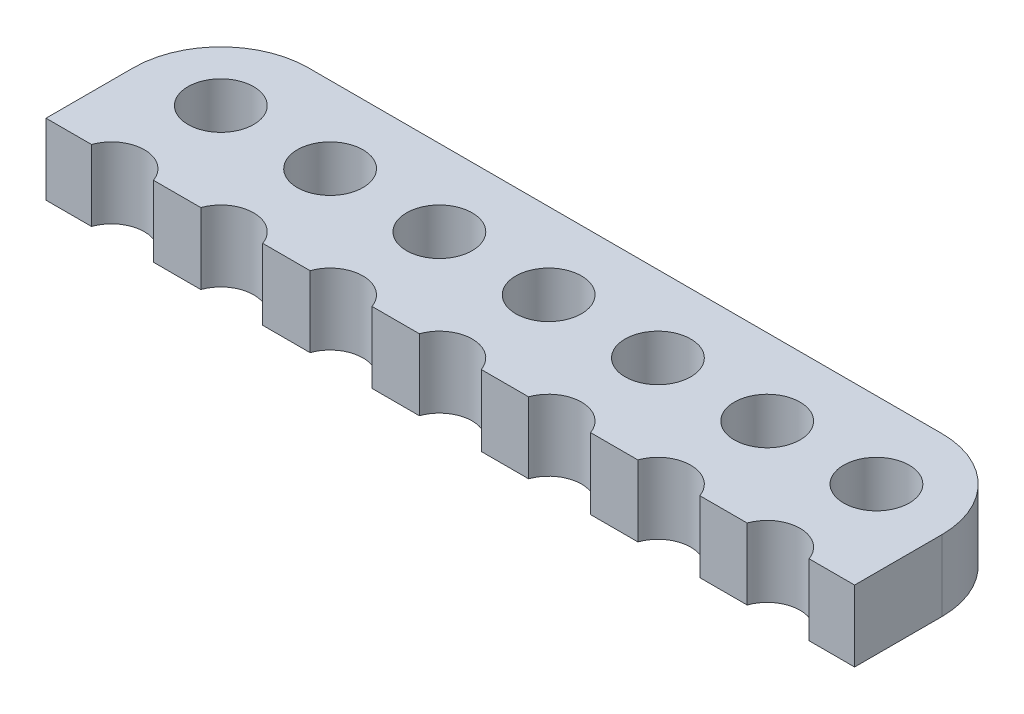
ISO-10303-21;
HEADER;
FILE_DESCRIPTION(('STEP AP214'),'2;1');
FILE_NAME('part.step','',(''),(''),'','','');
FILE_SCHEMA(('AUTOMOTIVE_DESIGN { 1 0 10303 214 1 1 1 1 }'));
ENDSEC;
DATA;
#1=APPLICATION_CONTEXT('core data for automotive mechanical design processes');
#2=APPLICATION_PROTOCOL_DEFINITION('international standard','automotive_design',2000,#1);
#3=PRODUCT_CONTEXT('',#1,'mechanical');
#4=PRODUCT('Part','Part','',(#3));
#5=PRODUCT_RELATED_PRODUCT_CATEGORY('part','',(#4));
#6=PRODUCT_DEFINITION_FORMATION('','',#4);
#7=PRODUCT_DEFINITION_CONTEXT('part definition',#1,'design');
#8=PRODUCT_DEFINITION('design','',#6,#7);
#9=PRODUCT_DEFINITION_SHAPE('','',#8);
#10=(LENGTH_UNIT() NAMED_UNIT(*) SI_UNIT(.MILLI.,.METRE.));
#11=(NAMED_UNIT(*) PLANE_ANGLE_UNIT() SI_UNIT($,.RADIAN.));
#12=(NAMED_UNIT(*) SI_UNIT($,.STERADIAN.) SOLID_ANGLE_UNIT());
#13=UNCERTAINTY_MEASURE_WITH_UNIT(LENGTH_MEASURE(1.E-05),#10,'distance_accuracy_value','');
#14=(GEOMETRIC_REPRESENTATION_CONTEXT(3) GLOBAL_UNCERTAINTY_ASSIGNED_CONTEXT((#13)) GLOBAL_UNIT_ASSIGNED_CONTEXT((#10,
#11,#12)) REPRESENTATION_CONTEXT('',''));
#15=CARTESIAN_POINT('',(0.,0.,0.));
#16=DIRECTION('',(0.,0.,1.));
#17=DIRECTION('',(1.,0.,0.));
#18=AXIS2_PLACEMENT_3D('',#15,#16,#17);
#19=CARTESIAN_POINT('',(14.5,3.25,0.));
#20=DIRECTION('',(0.,-1.,0.));
#21=DIRECTION('',(0.,0.,-1.));
#22=AXIS2_PLACEMENT_3D('',#19,#20,#21);
#23=PLANE('',#22);
#24=DIRECTION('',(1.,0.,0.));
#25=VECTOR('',#24,1.);
#26=CARTESIAN_POINT('',(16.4168649371059,3.25,4.));
#27=LINE('',#26,#25);
#28=CARTESIAN_POINT('',(16.4168649371059,3.25,4.));
#29=VERTEX_POINT('',#28);
#30=CARTESIAN_POINT('',(18.5,3.25,4.));
#31=VERTEX_POINT('',#30);
#32=EDGE_CURVE('E242',#29,#31,#27,.T.);
#33=ORIENTED_EDGE('',*,*,#32,.T.);
#34=DIRECTION('',(0.,0.,-1.));
#35=VECTOR('',#34,1.);
#36=CARTESIAN_POINT('',(18.5,3.25,0.));
#37=LINE('',#36,#35);
#38=CARTESIAN_POINT('',(18.5,3.25,0.));
#39=VERTEX_POINT('',#38);
#40=EDGE_CURVE('E130',#31,#39,#37,.T.);
#41=ORIENTED_EDGE('',*,*,#40,.T.);
#42=CARTESIAN_POINT('',(14.5,3.25,0.));
#43=DIRECTION('',(0.,1.,0.));
#44=DIRECTION('',(0.,0.,-1.));
#45=AXIS2_PLACEMENT_3D('',#42,#43,#44);
#46=CIRCLE('',#45,4.);
#47=CARTESIAN_POINT('',(14.5,3.25,-4.));
#48=VERTEX_POINT('',#47);
#49=EDGE_CURVE('E293',#39,#48,#46,.T.);
#50=ORIENTED_EDGE('',*,*,#49,.T.);
#51=DIRECTION('',(-1.,0.,0.));
#52=VECTOR('',#51,1.);
#53=CARTESIAN_POINT('',(-14.5,3.25,-4.));
#54=LINE('',#53,#52);
#55=CARTESIAN_POINT('',(-14.5,3.25,-4.));
#56=VERTEX_POINT('',#55);
#57=EDGE_CURVE('E312',#48,#56,#54,.T.);
#58=ORIENTED_EDGE('',*,*,#57,.T.);
#59=CARTESIAN_POINT('',(-14.5,3.25,0.));
#60=DIRECTION('',(0.,1.,0.));
#61=DIRECTION('',(0.,0.,1.));
#62=AXIS2_PLACEMENT_3D('',#59,#60,#61);
#63=CIRCLE('',#62,4.);
#64=CARTESIAN_POINT('',(-18.5,3.25,0.));
#65=VERTEX_POINT('',#64);
#66=EDGE_CURVE('E309',#56,#65,#63,.T.);
#67=ORIENTED_EDGE('',*,*,#66,.T.);
#68=DIRECTION('',(0.,0.,1.));
#69=VECTOR('',#68,1.);
#70=CARTESIAN_POINT('',(-18.5,3.25,0.));
#71=LINE('',#70,#69);
#72=CARTESIAN_POINT('',(-18.5,3.25,4.));
#73=VERTEX_POINT('',#72);
#74=EDGE_CURVE('E311',#65,#73,#71,.T.);
#75=ORIENTED_EDGE('',*,*,#74,.T.);
#76=DIRECTION('',(1.,0.,0.));
#77=VECTOR('',#76,1.);
#78=CARTESIAN_POINT('',(-18.5,3.25,4.));
#79=LINE('',#78,#77);
#80=CARTESIAN_POINT('',(-16.4168649371058,3.25,4.));
#81=VERTEX_POINT('',#80);
#82=EDGE_CURVE('E314',#73,#81,#79,.T.);
#83=ORIENTED_EDGE('',*,*,#82,.T.);
#84=CARTESIAN_POINT('',(-15.,3.25,4.5));
#85=DIRECTION('',(0.,-1.,0.));
#86=DIRECTION('',(0.,0.,1.));
#87=AXIS2_PLACEMENT_3D('',#84,#85,#86);
#88=CIRCLE('',#87,1.5025);
#89=CARTESIAN_POINT('',(-13.5831350628941,3.25,4.));
#90=VERTEX_POINT('',#89);
#91=EDGE_CURVE('E320',#81,#90,#88,.T.);
#92=ORIENTED_EDGE('',*,*,#91,.T.);
#93=DIRECTION('',(1.,0.,0.));
#94=VECTOR('',#93,1.);
#95=CARTESIAN_POINT('',(-13.5831350628941,3.25,4.));
#96=LINE('',#95,#94);
#97=CARTESIAN_POINT('',(-11.4168649371058,3.25,4.));
#98=VERTEX_POINT('',#97);
#99=EDGE_CURVE('E322',#90,#98,#96,.T.);
#100=ORIENTED_EDGE('',*,*,#99,.T.);
#101=CARTESIAN_POINT('',(-9.99999999999995,3.25,4.5));
#102=DIRECTION('',(0.,-1.,0.));
#103=DIRECTION('',(0.,0.,1.));
#104=AXIS2_PLACEMENT_3D('',#101,#102,#103);
#105=CIRCLE('',#104,1.5025);
#106=CARTESIAN_POINT('',(-8.58313506289409,3.25,4.));
#107=VERTEX_POINT('',#106);
#108=EDGE_CURVE('E324',#98,#107,#105,.T.);
#109=ORIENTED_EDGE('',*,*,#108,.T.);
#110=DIRECTION('',(1.,0.,0.));
#111=VECTOR('',#110,1.);
#112=CARTESIAN_POINT('',(-8.58313506289409,3.25,4.));
#113=LINE('',#112,#111);
#114=CARTESIAN_POINT('',(-6.41686493710581,3.25,4.));
#115=VERTEX_POINT('',#114);
#116=EDGE_CURVE('E326',#107,#115,#113,.T.);
#117=ORIENTED_EDGE('',*,*,#116,.T.);
#118=CARTESIAN_POINT('',(-4.99999999999995,3.25,4.5));
#119=DIRECTION('',(0.,-1.,0.));
#120=DIRECTION('',(0.,0.,1.));
#121=AXIS2_PLACEMENT_3D('',#118,#119,#120);
#122=CIRCLE('',#121,1.5025);
#123=CARTESIAN_POINT('',(-3.58313506289409,3.25,4.));
#124=VERTEX_POINT('',#123);
#125=EDGE_CURVE('E328',#115,#124,#122,.T.);
#126=ORIENTED_EDGE('',*,*,#125,.T.);
#127=DIRECTION('',(1.,0.,0.));
#128=VECTOR('',#127,1.);
#129=CARTESIAN_POINT('',(-3.58313506289409,3.25,4.));
#130=LINE('',#129,#128);
#131=CARTESIAN_POINT('',(-1.41686493710581,3.25,4.));
#132=VERTEX_POINT('',#131);
#133=EDGE_CURVE('E330',#124,#132,#130,.T.);
#134=ORIENTED_EDGE('',*,*,#133,.T.);
#135=CARTESIAN_POINT('',(0.,3.25,4.5));
#136=DIRECTION('',(0.,-1.,0.));
#137=DIRECTION('',(0.,0.,1.));
#138=AXIS2_PLACEMENT_3D('',#135,#136,#137);
#139=CIRCLE('',#138,1.5025);
#140=CARTESIAN_POINT('',(1.41686493710591,3.25,4.));
#141=VERTEX_POINT('',#140);
#142=EDGE_CURVE('E332',#132,#141,#139,.T.);
#143=ORIENTED_EDGE('',*,*,#142,.T.);
#144=DIRECTION('',(1.,0.,0.));
#145=VECTOR('',#144,1.);
#146=CARTESIAN_POINT('',(1.41686493710591,3.25,4.));
#147=LINE('',#146,#145);
#148=CARTESIAN_POINT('',(3.58313506289419,3.25,4.));
#149=VERTEX_POINT('',#148);
#150=EDGE_CURVE('E334',#141,#149,#147,.T.);
#151=ORIENTED_EDGE('',*,*,#150,.T.);
#152=CARTESIAN_POINT('',(5.00000000000005,3.25,4.5));
#153=DIRECTION('',(0.,-1.,0.));
#154=DIRECTION('',(0.,0.,1.));
#155=AXIS2_PLACEMENT_3D('',#152,#153,#154);
#156=CIRCLE('',#155,1.5025);
#157=CARTESIAN_POINT('',(6.41686493710591,3.25,4.));
#158=VERTEX_POINT('',#157);
#159=EDGE_CURVE('E336',#149,#158,#156,.T.);
#160=ORIENTED_EDGE('',*,*,#159,.T.);
#161=DIRECTION('',(1.,0.,0.));
#162=VECTOR('',#161,1.);
#163=CARTESIAN_POINT('',(6.41686493710591,3.25,4.));
#164=LINE('',#163,#162);
#165=CARTESIAN_POINT('',(8.58313506289419,3.25,4.));
#166=VERTEX_POINT('',#165);
#167=EDGE_CURVE('E185',#158,#166,#164,.T.);
#168=ORIENTED_EDGE('',*,*,#167,.T.);
#169=CARTESIAN_POINT('',(10.,3.25,4.5));
#170=DIRECTION('',(0.,-1.,0.));
#171=DIRECTION('',(0.,0.,1.));
#172=AXIS2_PLACEMENT_3D('',#169,#170,#171);
#173=CIRCLE('',#172,1.5025);
#174=CARTESIAN_POINT('',(11.4168649371059,3.25,4.));
#175=VERTEX_POINT('',#174);
#176=EDGE_CURVE('E179',#166,#175,#173,.T.);
#177=ORIENTED_EDGE('',*,*,#176,.T.);
#178=DIRECTION('',(1.,0.,0.));
#179=VECTOR('',#178,1.);
#180=CARTESIAN_POINT('',(11.4168649371059,3.25,4.));
#181=LINE('',#180,#179);
#182=CARTESIAN_POINT('',(13.5831350628942,3.25,4.));
#183=VERTEX_POINT('',#182);
#184=EDGE_CURVE('E183',#175,#183,#181,.T.);
#185=ORIENTED_EDGE('',*,*,#184,.T.);
#186=CARTESIAN_POINT('',(15.,3.25,4.5));
#187=DIRECTION('',(0.,-1.,0.));
#188=DIRECTION('',(0.,0.,1.));
#189=AXIS2_PLACEMENT_3D('',#186,#187,#188);
#190=CIRCLE('',#189,1.5025);
#191=EDGE_CURVE('E51',#183,#29,#190,.T.);
#192=ORIENTED_EDGE('',*,*,#191,.T.);
#193=EDGE_LOOP('',(#33,#41,#50,#58,#67,#75,#83,#92,#100,#109,#117,#126,#134,#143,#151,#160,#168,
#177,#185,#192));
#194=FACE_BOUND('',#193,.T.);
#195=CARTESIAN_POINT('',(-15.,3.25,-0.5));
#196=DIRECTION('',(0.,1.,0.));
#197=DIRECTION('',(0.,0.,1.));
#198=AXIS2_PLACEMENT_3D('',#195,#196,#197);
#199=CIRCLE('',#198,1.5025);
#200=CARTESIAN_POINT('',(-15.,3.25,1.0025));
#201=VERTEX_POINT('',#200);
#202=EDGE_CURVE('E207',#201,#201,#199,.T.);
#203=ORIENTED_EDGE('',*,*,#202,.F.);
#204=EDGE_LOOP('',(#203));
#205=FACE_BOUND('',#204,.T.);
#206=CARTESIAN_POINT('',(-10.,3.25,-0.5));
#207=DIRECTION('',(0.,1.,0.));
#208=DIRECTION('',(0.,0.,1.));
#209=AXIS2_PLACEMENT_3D('',#206,#207,#208);
#210=CIRCLE('',#209,1.5025);
#211=CARTESIAN_POINT('',(-10.,3.25,1.0025));
#212=VERTEX_POINT('',#211);
#213=EDGE_CURVE('E430',#212,#212,#210,.T.);
#214=ORIENTED_EDGE('',*,*,#213,.F.);
#215=EDGE_LOOP('',(#214));
#216=FACE_BOUND('',#215,.T.);
#217=CARTESIAN_POINT('',(-5.,3.25,-0.5));
#218=DIRECTION('',(0.,1.,0.));
#219=DIRECTION('',(0.,0.,1.));
#220=AXIS2_PLACEMENT_3D('',#217,#218,#219);
#221=CIRCLE('',#220,1.5025);
#222=CARTESIAN_POINT('',(-5.,3.25,1.0025));
#223=VERTEX_POINT('',#222);
#224=EDGE_CURVE('E424',#223,#223,#221,.T.);
#225=ORIENTED_EDGE('',*,*,#224,.F.);
#226=EDGE_LOOP('',(#225));
#227=FACE_BOUND('',#226,.T.);
#228=CARTESIAN_POINT('',(0.,3.25,-0.5));
#229=DIRECTION('',(0.,1.,0.));
#230=DIRECTION('',(0.,0.,1.));
#231=AXIS2_PLACEMENT_3D('',#228,#229,#230);
#232=CIRCLE('',#231,1.5025);
#233=CARTESIAN_POINT('',(0.,3.25,1.0025));
#234=VERTEX_POINT('',#233);
#235=EDGE_CURVE('E418',#234,#234,#232,.T.);
#236=ORIENTED_EDGE('',*,*,#235,.F.);
#237=EDGE_LOOP('',(#236));
#238=FACE_BOUND('',#237,.T.);
#239=CARTESIAN_POINT('',(5.,3.25,-0.5));
#240=DIRECTION('',(0.,1.,0.));
#241=DIRECTION('',(0.,0.,1.));
#242=AXIS2_PLACEMENT_3D('',#239,#240,#241);
#243=CIRCLE('',#242,1.5025);
#244=CARTESIAN_POINT('',(5.,3.25,1.0025));
#245=VERTEX_POINT('',#244);
#246=EDGE_CURVE('E412',#245,#245,#243,.T.);
#247=ORIENTED_EDGE('',*,*,#246,.F.);
#248=EDGE_LOOP('',(#247));
#249=FACE_BOUND('',#248,.T.);
#250=CARTESIAN_POINT('',(10.,3.25,-0.5));
#251=DIRECTION('',(0.,1.,0.));
#252=DIRECTION('',(0.,0.,1.));
#253=AXIS2_PLACEMENT_3D('',#250,#251,#252);
#254=CIRCLE('',#253,1.5025);
#255=CARTESIAN_POINT('',(10.,3.25,1.0025));
#256=VERTEX_POINT('',#255);
#257=EDGE_CURVE('E406',#256,#256,#254,.T.);
#258=ORIENTED_EDGE('',*,*,#257,.F.);
#259=EDGE_LOOP('',(#258));
#260=FACE_BOUND('',#259,.T.);
#261=CARTESIAN_POINT('',(15.,3.25,-0.5));
#262=DIRECTION('',(0.,1.,0.));
#263=DIRECTION('',(0.,0.,1.));
#264=AXIS2_PLACEMENT_3D('',#261,#262,#263);
#265=CIRCLE('',#264,1.5025);
#266=CARTESIAN_POINT('',(15.,3.25,1.0025));
#267=VERTEX_POINT('',#266);
#268=EDGE_CURVE('E397',#267,#267,#265,.T.);
#269=ORIENTED_EDGE('',*,*,#268,.F.);
#270=EDGE_LOOP('',(#269));
#271=FACE_BOUND('',#270,.T.);
#272=ADVANCED_FACE('F34',(#194,#205,#216,#227,#238,#249,#260,#271),#23,.F.);
#273=CARTESIAN_POINT('',(14.5,0.,0.));
#274=DIRECTION('',(0.,-1.,0.));
#275=DIRECTION('',(0.,0.,-1.));
#276=AXIS2_PLACEMENT_3D('',#273,#274,#275);
#277=PLANE('',#276);
#278=CARTESIAN_POINT('',(10.,0.,-0.5));
#279=DIRECTION('',(0.,1.,0.));
#280=DIRECTION('',(0.,0.,1.));
#281=AXIS2_PLACEMENT_3D('',#278,#279,#280);
#282=CIRCLE('',#281,1.5025);
#283=CARTESIAN_POINT('',(10.,0.,1.0025));
#284=VERTEX_POINT('',#283);
#285=EDGE_CURVE('E403',#284,#284,#282,.T.);
#286=ORIENTED_EDGE('',*,*,#285,.T.);
#287=EDGE_LOOP('',(#286));
#288=FACE_BOUND('',#287,.T.);
#289=CARTESIAN_POINT('',(0.,0.,-0.5));
#290=DIRECTION('',(0.,1.,0.));
#291=DIRECTION('',(0.,0.,1.));
#292=AXIS2_PLACEMENT_3D('',#289,#290,#291);
#293=CIRCLE('',#292,1.5025);
#294=CARTESIAN_POINT('',(0.,0.,1.0025));
#295=VERTEX_POINT('',#294);
#296=EDGE_CURVE('E415',#295,#295,#293,.T.);
#297=ORIENTED_EDGE('',*,*,#296,.T.);
#298=EDGE_LOOP('',(#297));
#299=FACE_BOUND('',#298,.T.);
#300=CARTESIAN_POINT('',(-10.,0.,-0.5));
#301=DIRECTION('',(0.,1.,0.));
#302=DIRECTION('',(0.,0.,1.));
#303=AXIS2_PLACEMENT_3D('',#300,#301,#302);
#304=CIRCLE('',#303,1.5025);
#305=CARTESIAN_POINT('',(-10.,0.,1.0025));
#306=VERTEX_POINT('',#305);
#307=EDGE_CURVE('E427',#306,#306,#304,.T.);
#308=ORIENTED_EDGE('',*,*,#307,.T.);
#309=EDGE_LOOP('',(#308));
#310=FACE_BOUND('',#309,.T.);
#311=DIRECTION('',(1.,0.,0.));
#312=VECTOR('',#311,1.);
#313=CARTESIAN_POINT('',(16.4168649371059,0.,4.));
#314=LINE('',#313,#312);
#315=CARTESIAN_POINT('',(16.4168649371059,0.,4.));
#316=VERTEX_POINT('',#315);
#317=CARTESIAN_POINT('',(18.5,0.,4.));
#318=VERTEX_POINT('',#317);
#319=EDGE_CURVE('E203',#316,#318,#314,.T.);
#320=ORIENTED_EDGE('',*,*,#319,.F.);
#321=CARTESIAN_POINT('',(15.,0.,4.5));
#322=DIRECTION('',(0.,-1.,0.));
#323=DIRECTION('',(0.,0.,1.));
#324=AXIS2_PLACEMENT_3D('',#321,#322,#323);
#325=CIRCLE('',#324,1.5025);
#326=CARTESIAN_POINT('',(13.5831350628942,0.,4.));
#327=VERTEX_POINT('',#326);
#328=EDGE_CURVE('E122',#327,#316,#325,.T.);
#329=ORIENTED_EDGE('',*,*,#328,.F.);
#330=DIRECTION('',(1.,0.,0.));
#331=VECTOR('',#330,1.);
#332=CARTESIAN_POINT('',(11.4168649371059,0.,4.));
#333=LINE('',#332,#331);
#334=CARTESIAN_POINT('',(11.4168649371059,0.,4.));
#335=VERTEX_POINT('',#334);
#336=EDGE_CURVE('E116',#335,#327,#333,.T.);
#337=ORIENTED_EDGE('',*,*,#336,.F.);
#338=CARTESIAN_POINT('',(10.,0.,4.5));
#339=DIRECTION('',(0.,-1.,0.));
#340=DIRECTION('',(0.,0.,1.));
#341=AXIS2_PLACEMENT_3D('',#338,#339,#340);
#342=CIRCLE('',#341,1.5025);
#343=CARTESIAN_POINT('',(8.58313506289419,0.,4.));
#344=VERTEX_POINT('',#343);
#345=EDGE_CURVE('E193',#344,#335,#342,.T.);
#346=ORIENTED_EDGE('',*,*,#345,.F.);
#347=DIRECTION('',(1.,0.,0.));
#348=VECTOR('',#347,1.);
#349=CARTESIAN_POINT('',(6.41686493710591,0.,4.));
#350=LINE('',#349,#348);
#351=CARTESIAN_POINT('',(6.41686493710591,0.,4.));
#352=VERTEX_POINT('',#351);
#353=EDGE_CURVE('E237',#352,#344,#350,.T.);
#354=ORIENTED_EDGE('',*,*,#353,.F.);
#355=CARTESIAN_POINT('',(5.00000000000005,0.,4.5));
#356=DIRECTION('',(0.,-1.,0.));
#357=DIRECTION('',(0.,0.,1.));
#358=AXIS2_PLACEMENT_3D('',#355,#356,#357);
#359=CIRCLE('',#358,1.5025);
#360=CARTESIAN_POINT('',(3.58313506289419,0.,4.));
#361=VERTEX_POINT('',#360);
#362=EDGE_CURVE('E235',#361,#352,#359,.T.);
#363=ORIENTED_EDGE('',*,*,#362,.F.);
#364=DIRECTION('',(1.,0.,0.));
#365=VECTOR('',#364,1.);
#366=CARTESIAN_POINT('',(1.41686493710591,0.,4.));
#367=LINE('',#366,#365);
#368=CARTESIAN_POINT('',(1.41686493710591,0.,4.));
#369=VERTEX_POINT('',#368);
#370=EDGE_CURVE('E233',#369,#361,#367,.T.);
#371=ORIENTED_EDGE('',*,*,#370,.F.);
#372=CARTESIAN_POINT('',(0.,0.,4.5));
#373=DIRECTION('',(0.,-1.,0.));
#374=DIRECTION('',(0.,0.,1.));
#375=AXIS2_PLACEMENT_3D('',#372,#373,#374);
#376=CIRCLE('',#375,1.5025);
#377=CARTESIAN_POINT('',(-1.41686493710581,0.,4.));
#378=VERTEX_POINT('',#377);
#379=EDGE_CURVE('E231',#378,#369,#376,.T.);
#380=ORIENTED_EDGE('',*,*,#379,.F.);
#381=DIRECTION('',(1.,0.,0.));
#382=VECTOR('',#381,1.);
#383=CARTESIAN_POINT('',(-3.58313506289409,0.,4.));
#384=LINE('',#383,#382);
#385=CARTESIAN_POINT('',(-3.58313506289409,0.,4.));
#386=VERTEX_POINT('',#385);
#387=EDGE_CURVE('E229',#386,#378,#384,.T.);
#388=ORIENTED_EDGE('',*,*,#387,.F.);
#389=CARTESIAN_POINT('',(-4.99999999999995,0.,4.5));
#390=DIRECTION('',(0.,-1.,0.));
#391=DIRECTION('',(0.,0.,1.));
#392=AXIS2_PLACEMENT_3D('',#389,#390,#391);
#393=CIRCLE('',#392,1.5025);
#394=CARTESIAN_POINT('',(-6.41686493710581,0.,4.));
#395=VERTEX_POINT('',#394);
#396=EDGE_CURVE('E227',#395,#386,#393,.T.);
#397=ORIENTED_EDGE('',*,*,#396,.F.);
#398=DIRECTION('',(1.,0.,0.));
#399=VECTOR('',#398,1.);
#400=CARTESIAN_POINT('',(-8.58313506289409,0.,4.));
#401=LINE('',#400,#399);
#402=CARTESIAN_POINT('',(-8.58313506289409,0.,4.));
#403=VERTEX_POINT('',#402);
#404=EDGE_CURVE('E225',#403,#395,#401,.T.);
#405=ORIENTED_EDGE('',*,*,#404,.F.);
#406=CARTESIAN_POINT('',(-9.99999999999995,0.,4.5));
#407=DIRECTION('',(0.,-1.,0.));
#408=DIRECTION('',(0.,0.,1.));
#409=AXIS2_PLACEMENT_3D('',#406,#407,#408);
#410=CIRCLE('',#409,1.5025);
#411=CARTESIAN_POINT('',(-11.4168649371058,0.,4.));
#412=VERTEX_POINT('',#411);
#413=EDGE_CURVE('E223',#412,#403,#410,.T.);
#414=ORIENTED_EDGE('',*,*,#413,.F.);
#415=DIRECTION('',(1.,0.,0.));
#416=VECTOR('',#415,1.);
#417=CARTESIAN_POINT('',(-13.5831350628941,0.,4.));
#418=LINE('',#417,#416);
#419=CARTESIAN_POINT('',(-13.5831350628941,0.,4.));
#420=VERTEX_POINT('',#419);
#421=EDGE_CURVE('E221',#420,#412,#418,.T.);
#422=ORIENTED_EDGE('',*,*,#421,.F.);
#423=CARTESIAN_POINT('',(-15.,0.,4.5));
#424=DIRECTION('',(0.,-1.,0.));
#425=DIRECTION('',(0.,0.,1.));
#426=AXIS2_PLACEMENT_3D('',#423,#424,#425);
#427=CIRCLE('',#426,1.5025);
#428=CARTESIAN_POINT('',(-16.4168649371058,0.,4.));
#429=VERTEX_POINT('',#428);
#430=EDGE_CURVE('E219',#429,#420,#427,.T.);
#431=ORIENTED_EDGE('',*,*,#430,.F.);
#432=DIRECTION('',(1.,0.,0.));
#433=VECTOR('',#432,1.);
#434=CARTESIAN_POINT('',(-18.5,0.,4.));
#435=LINE('',#434,#433);
#436=CARTESIAN_POINT('',(-18.5,0.,4.));
#437=VERTEX_POINT('',#436);
#438=EDGE_CURVE('E217',#437,#429,#435,.T.);
#439=ORIENTED_EDGE('',*,*,#438,.F.);
#440=DIRECTION('',(0.,0.,1.));
#441=VECTOR('',#440,1.);
#442=CARTESIAN_POINT('',(-18.5,0.,0.));
#443=LINE('',#442,#441);
#444=CARTESIAN_POINT('',(-18.5,0.,0.));
#445=VERTEX_POINT('',#444);
#446=EDGE_CURVE('E215',#445,#437,#443,.T.);
#447=ORIENTED_EDGE('',*,*,#446,.F.);
#448=CARTESIAN_POINT('',(-14.5,0.,0.));
#449=DIRECTION('',(0.,1.,0.));
#450=DIRECTION('',(0.,0.,1.));
#451=AXIS2_PLACEMENT_3D('',#448,#449,#450);
#452=CIRCLE('',#451,4.);
#453=CARTESIAN_POINT('',(-14.5,0.,-4.));
#454=VERTEX_POINT('',#453);
#455=EDGE_CURVE('E213',#454,#445,#452,.T.);
#456=ORIENTED_EDGE('',*,*,#455,.F.);
#457=DIRECTION('',(-1.,0.,0.));
#458=VECTOR('',#457,1.);
#459=CARTESIAN_POINT('',(-14.5,0.,-4.));
#460=LINE('',#459,#458);
#461=CARTESIAN_POINT('',(14.5,0.,-4.));
#462=VERTEX_POINT('',#461);
#463=EDGE_CURVE('E211',#462,#454,#460,.T.);
#464=ORIENTED_EDGE('',*,*,#463,.F.);
#465=CARTESIAN_POINT('',(14.5,0.,0.));
#466=DIRECTION('',(0.,1.,0.));
#467=DIRECTION('',(0.,0.,-1.));
#468=AXIS2_PLACEMENT_3D('',#465,#466,#467);
#469=CIRCLE('',#468,4.);
#470=CARTESIAN_POINT('',(18.5,0.,0.));
#471=VERTEX_POINT('',#470);
#472=EDGE_CURVE('E209',#471,#462,#469,.T.);
#473=ORIENTED_EDGE('',*,*,#472,.F.);
#474=DIRECTION('',(0.,0.,-1.));
#475=VECTOR('',#474,1.);
#476=CARTESIAN_POINT('',(18.5,0.,0.));
#477=LINE('',#476,#475);
#478=EDGE_CURVE('E206',#318,#471,#477,.T.);
#479=ORIENTED_EDGE('',*,*,#478,.F.);
#480=EDGE_LOOP('',(#320,#329,#337,#346,#354,#363,#371,#380,#388,#397,#405,#414,#422,#431,#439,
#447,#456,#464,#473,#479));
#481=FACE_BOUND('',#480,.T.);
#482=CARTESIAN_POINT('',(-15.,0.,-0.5));
#483=DIRECTION('',(0.,1.,0.));
#484=DIRECTION('',(0.,0.,1.));
#485=AXIS2_PLACEMENT_3D('',#482,#483,#484);
#486=CIRCLE('',#485,1.5025);
#487=CARTESIAN_POINT('',(-15.,0.,1.0025));
#488=VERTEX_POINT('',#487);
#489=EDGE_CURVE('E433',#488,#488,#486,.T.);
#490=ORIENTED_EDGE('',*,*,#489,.T.);
#491=EDGE_LOOP('',(#490));
#492=FACE_BOUND('',#491,.T.);
#493=CARTESIAN_POINT('',(-5.,0.,-0.5));
#494=DIRECTION('',(0.,1.,0.));
#495=DIRECTION('',(0.,0.,1.));
#496=AXIS2_PLACEMENT_3D('',#493,#494,#495);
#497=CIRCLE('',#496,1.5025);
#498=CARTESIAN_POINT('',(-5.,0.,1.0025));
#499=VERTEX_POINT('',#498);
#500=EDGE_CURVE('E421',#499,#499,#497,.T.);
#501=ORIENTED_EDGE('',*,*,#500,.T.);
#502=EDGE_LOOP('',(#501));
#503=FACE_BOUND('',#502,.T.);
#504=CARTESIAN_POINT('',(5.,0.,-0.5));
#505=DIRECTION('',(0.,1.,0.));
#506=DIRECTION('',(0.,0.,1.));
#507=AXIS2_PLACEMENT_3D('',#504,#505,#506);
#508=CIRCLE('',#507,1.5025);
#509=CARTESIAN_POINT('',(5.,0.,1.0025));
#510=VERTEX_POINT('',#509);
#511=EDGE_CURVE('E409',#510,#510,#508,.T.);
#512=ORIENTED_EDGE('',*,*,#511,.T.);
#513=EDGE_LOOP('',(#512));
#514=FACE_BOUND('',#513,.T.);
#515=CARTESIAN_POINT('',(15.,0.,-0.5));
#516=DIRECTION('',(0.,1.,0.));
#517=DIRECTION('',(0.,0.,1.));
#518=AXIS2_PLACEMENT_3D('',#515,#516,#517);
#519=CIRCLE('',#518,1.5025);
#520=CARTESIAN_POINT('',(15.,0.,1.0025));
#521=VERTEX_POINT('',#520);
#522=EDGE_CURVE('E400',#521,#521,#519,.T.);
#523=ORIENTED_EDGE('',*,*,#522,.T.);
#524=EDGE_LOOP('',(#523));
#525=FACE_BOUND('',#524,.T.);
#526=ADVANCED_FACE('F297',(#288,#299,#310,#481,#492,#503,#514,#525),#277,.T.);
#527=CARTESIAN_POINT('',(16.4168649371059,3.25,4.));
#528=DIRECTION('',(0.,0.,-1.));
#529=DIRECTION('',(-1.,0.,0.));
#530=AXIS2_PLACEMENT_3D('',#527,#528,#529);
#531=PLANE('',#530);
#532=ORIENTED_EDGE('',*,*,#319,.T.);
#533=DIRECTION('',(0.,-1.,0.));
#534=VECTOR('',#533,1.);
#535=CARTESIAN_POINT('',(18.5,3.25,4.));
#536=LINE('',#535,#534);
#537=EDGE_CURVE('E11',#31,#318,#536,.T.);
#538=ORIENTED_EDGE('',*,*,#537,.F.);
#539=ORIENTED_EDGE('',*,*,#32,.F.);
#540=DIRECTION('',(0.,-1.,0.));
#541=VECTOR('',#540,1.);
#542=CARTESIAN_POINT('',(16.4168649371059,3.25,4.));
#543=LINE('',#542,#541);
#544=EDGE_CURVE('E199',#29,#316,#543,.T.);
#545=ORIENTED_EDGE('',*,*,#544,.T.);
#546=EDGE_LOOP('',(#532,#538,#539,#545));
#547=FACE_BOUND('',#546,.T.);
#548=ADVANCED_FACE('F36',(#547),#531,.F.);
#549=CARTESIAN_POINT('',(18.5,3.25,0.));
#550=DIRECTION('',(-1.,0.,0.));
#551=DIRECTION('',(0.,0.,1.));
#552=AXIS2_PLACEMENT_3D('',#549,#550,#551);
#553=PLANE('',#552);
#554=ORIENTED_EDGE('',*,*,#478,.T.);
#555=DIRECTION('',(0.,-1.,0.));
#556=VECTOR('',#555,1.);
#557=CARTESIAN_POINT('',(18.5,3.25,0.));
#558=LINE('',#557,#556);
#559=EDGE_CURVE('E43',#39,#471,#558,.T.);
#560=ORIENTED_EDGE('',*,*,#559,.F.);
#561=ORIENTED_EDGE('',*,*,#40,.F.);
#562=ORIENTED_EDGE('',*,*,#537,.T.);
#563=EDGE_LOOP('',(#554,#560,#561,#562));
#564=FACE_BOUND('',#563,.T.);
#565=ADVANCED_FACE('F652',(#564),#553,.F.);
#566=CARTESIAN_POINT('',(14.5,3.25,0.));
#567=DIRECTION('',(0.,-1.,0.));
#568=DIRECTION('',(0.,0.,-1.));
#569=AXIS2_PLACEMENT_3D('',#566,#567,#568);
#570=CYLINDRICAL_SURFACE('',#569,4.);
#571=ORIENTED_EDGE('',*,*,#472,.T.);
#572=DIRECTION('',(0.,-1.,0.));
#573=VECTOR('',#572,1.);
#574=CARTESIAN_POINT('',(14.5,3.25,-4.));
#575=LINE('',#574,#573);
#576=EDGE_CURVE('E285',#48,#462,#575,.T.);
#577=ORIENTED_EDGE('',*,*,#576,.F.);
#578=ORIENTED_EDGE('',*,*,#49,.F.);
#579=ORIENTED_EDGE('',*,*,#559,.T.);
#580=EDGE_LOOP('',(#571,#577,#578,#579));
#581=FACE_BOUND('',#580,.T.);
#582=ADVANCED_FACE('F291',(#581),#570,.T.);
#583=CARTESIAN_POINT('',(-14.5,3.25,-4.));
#584=DIRECTION('',(0.,0.,1.));
#585=DIRECTION('',(1.,0.,0.));
#586=AXIS2_PLACEMENT_3D('',#583,#584,#585);
#587=PLANE('',#586);
#588=ORIENTED_EDGE('',*,*,#463,.T.);
#589=DIRECTION('',(0.,-1.,0.));
#590=VECTOR('',#589,1.);
#591=CARTESIAN_POINT('',(-14.5,3.25,-4.));
#592=LINE('',#591,#590);
#593=EDGE_CURVE('E282',#56,#454,#592,.T.);
#594=ORIENTED_EDGE('',*,*,#593,.F.);
#595=ORIENTED_EDGE('',*,*,#57,.F.);
#596=ORIENTED_EDGE('',*,*,#576,.T.);
#597=EDGE_LOOP('',(#588,#594,#595,#596));
#598=FACE_BOUND('',#597,.T.);
#599=ADVANCED_FACE('F303',(#598),#587,.F.);
#600=CARTESIAN_POINT('',(-14.5,3.25,0.));
#601=DIRECTION('',(0.,-1.,0.));
#602=DIRECTION('',(0.,0.,-1.));
#603=AXIS2_PLACEMENT_3D('',#600,#601,#602);
#604=CYLINDRICAL_SURFACE('',#603,4.);
#605=ORIENTED_EDGE('',*,*,#455,.T.);
#606=DIRECTION('',(0.,-1.,0.));
#607=VECTOR('',#606,1.);
#608=CARTESIAN_POINT('',(-18.5,3.25,0.));
#609=LINE('',#608,#607);
#610=EDGE_CURVE('E279',#65,#445,#609,.T.);
#611=ORIENTED_EDGE('',*,*,#610,.F.);
#612=ORIENTED_EDGE('',*,*,#66,.F.);
#613=ORIENTED_EDGE('',*,*,#593,.T.);
#614=EDGE_LOOP('',(#605,#611,#612,#613));
#615=FACE_BOUND('',#614,.T.);
#616=ADVANCED_FACE('F307',(#615),#604,.T.);
#617=CARTESIAN_POINT('',(-18.5,3.25,0.));
#618=DIRECTION('',(1.,0.,0.));
#619=DIRECTION('',(0.,0.,-1.));
#620=AXIS2_PLACEMENT_3D('',#617,#618,#619);
#621=PLANE('',#620);
#622=ORIENTED_EDGE('',*,*,#446,.T.);
#623=DIRECTION('',(0.,-1.,0.));
#624=VECTOR('',#623,1.);
#625=CARTESIAN_POINT('',(-18.5,3.25,4.));
#626=LINE('',#625,#624);
#627=EDGE_CURVE('E276',#73,#437,#626,.T.);
#628=ORIENTED_EDGE('',*,*,#627,.F.);
#629=ORIENTED_EDGE('',*,*,#74,.F.);
#630=ORIENTED_EDGE('',*,*,#610,.T.);
#631=EDGE_LOOP('',(#622,#628,#629,#630));
#632=FACE_BOUND('',#631,.T.);
#633=ADVANCED_FACE('F617',(#632),#621,.F.);
#634=CARTESIAN_POINT('',(-18.5,3.25,4.));
#635=DIRECTION('',(0.,0.,-1.));
#636=DIRECTION('',(-1.,0.,0.));
#637=AXIS2_PLACEMENT_3D('',#634,#635,#636);
#638=PLANE('',#637);
#639=ORIENTED_EDGE('',*,*,#438,.T.);
#640=DIRECTION('',(0.,-1.,0.));
#641=VECTOR('',#640,1.);
#642=CARTESIAN_POINT('',(-16.4168649371058,3.25,4.));
#643=LINE('',#642,#641);
#644=EDGE_CURVE('E273',#81,#429,#643,.T.);
#645=ORIENTED_EDGE('',*,*,#644,.F.);
#646=ORIENTED_EDGE('',*,*,#82,.F.);
#647=ORIENTED_EDGE('',*,*,#627,.T.);
#648=EDGE_LOOP('',(#639,#645,#646,#647));
#649=FACE_BOUND('',#648,.T.);
#650=ADVANCED_FACE('F607',(#649),#638,.F.);
#651=CARTESIAN_POINT('',(-15.,3.25,4.5));
#652=DIRECTION('',(0.,-1.,0.));
#653=DIRECTION('',(0.,0.,-1.));
#654=AXIS2_PLACEMENT_3D('',#651,#652,#653);
#655=CYLINDRICAL_SURFACE('',#654,1.5025);
#656=ORIENTED_EDGE('',*,*,#430,.T.);
#657=DIRECTION('',(0.,-1.,0.));
#658=VECTOR('',#657,1.);
#659=CARTESIAN_POINT('',(-13.5831350628941,3.25,4.));
#660=LINE('',#659,#658);
#661=EDGE_CURVE('E270',#90,#420,#660,.T.);
#662=ORIENTED_EDGE('',*,*,#661,.F.);
#663=ORIENTED_EDGE('',*,*,#91,.F.);
#664=ORIENTED_EDGE('',*,*,#644,.T.);
#665=EDGE_LOOP('',(#656,#662,#663,#664));
#666=FACE_BOUND('',#665,.T.);
#667=ADVANCED_FACE('F597',(#666),#655,.F.);
#668=CARTESIAN_POINT('',(-13.5831350628941,3.25,4.));
#669=DIRECTION('',(0.,0.,-1.));
#670=DIRECTION('',(-1.,0.,0.));
#671=AXIS2_PLACEMENT_3D('',#668,#669,#670);
#672=PLANE('',#671);
#673=ORIENTED_EDGE('',*,*,#421,.T.);
#674=DIRECTION('',(0.,-1.,0.));
#675=VECTOR('',#674,1.);
#676=CARTESIAN_POINT('',(-11.4168649371058,3.25,4.));
#677=LINE('',#676,#675);
#678=EDGE_CURVE('E267',#98,#412,#677,.T.);
#679=ORIENTED_EDGE('',*,*,#678,.F.);
#680=ORIENTED_EDGE('',*,*,#99,.F.);
#681=ORIENTED_EDGE('',*,*,#661,.T.);
#682=EDGE_LOOP('',(#673,#679,#680,#681));
#683=FACE_BOUND('',#682,.T.);
#684=ADVANCED_FACE('F587',(#683),#672,.F.);
#685=CARTESIAN_POINT('',(-9.99999999999995,3.25,4.5));
#686=DIRECTION('',(0.,-1.,0.));
#687=DIRECTION('',(0.,0.,-1.));
#688=AXIS2_PLACEMENT_3D('',#685,#686,#687);
#689=CYLINDRICAL_SURFACE('',#688,1.5025);
#690=ORIENTED_EDGE('',*,*,#413,.T.);
#691=DIRECTION('',(0.,-1.,0.));
#692=VECTOR('',#691,1.);
#693=CARTESIAN_POINT('',(-8.58313506289409,3.25,4.));
#694=LINE('',#693,#692);
#695=EDGE_CURVE('E264',#107,#403,#694,.T.);
#696=ORIENTED_EDGE('',*,*,#695,.F.);
#697=ORIENTED_EDGE('',*,*,#108,.F.);
#698=ORIENTED_EDGE('',*,*,#678,.T.);
#699=EDGE_LOOP('',(#690,#696,#697,#698));
#700=FACE_BOUND('',#699,.T.);
#701=ADVANCED_FACE('F577',(#700),#689,.F.);
#702=CARTESIAN_POINT('',(-8.58313506289409,3.25,4.));
#703=DIRECTION('',(0.,0.,-1.));
#704=DIRECTION('',(-1.,0.,0.));
#705=AXIS2_PLACEMENT_3D('',#702,#703,#704);
#706=PLANE('',#705);
#707=ORIENTED_EDGE('',*,*,#404,.T.);
#708=DIRECTION('',(0.,-1.,0.));
#709=VECTOR('',#708,1.);
#710=CARTESIAN_POINT('',(-6.41686493710581,3.25,4.));
#711=LINE('',#710,#709);
#712=EDGE_CURVE('E261',#115,#395,#711,.T.);
#713=ORIENTED_EDGE('',*,*,#712,.F.);
#714=ORIENTED_EDGE('',*,*,#116,.F.);
#715=ORIENTED_EDGE('',*,*,#695,.T.);
#716=EDGE_LOOP('',(#707,#713,#714,#715));
#717=FACE_BOUND('',#716,.T.);
#718=ADVANCED_FACE('F567',(#717),#706,.F.);
#719=CARTESIAN_POINT('',(-4.99999999999995,3.25,4.5));
#720=DIRECTION('',(0.,-1.,0.));
#721=DIRECTION('',(0.,0.,-1.));
#722=AXIS2_PLACEMENT_3D('',#719,#720,#721);
#723=CYLINDRICAL_SURFACE('',#722,1.5025);
#724=ORIENTED_EDGE('',*,*,#396,.T.);
#725=DIRECTION('',(0.,-1.,0.));
#726=VECTOR('',#725,1.);
#727=CARTESIAN_POINT('',(-3.58313506289409,3.25,4.));
#728=LINE('',#727,#726);
#729=EDGE_CURVE('E258',#124,#386,#728,.T.);
#730=ORIENTED_EDGE('',*,*,#729,.F.);
#731=ORIENTED_EDGE('',*,*,#125,.F.);
#732=ORIENTED_EDGE('',*,*,#712,.T.);
#733=EDGE_LOOP('',(#724,#730,#731,#732));
#734=FACE_BOUND('',#733,.T.);
#735=ADVANCED_FACE('F557',(#734),#723,.F.);
#736=CARTESIAN_POINT('',(-3.58313506289409,3.25,4.));
#737=DIRECTION('',(0.,0.,-1.));
#738=DIRECTION('',(-1.,0.,0.));
#739=AXIS2_PLACEMENT_3D('',#736,#737,#738);
#740=PLANE('',#739);
#741=ORIENTED_EDGE('',*,*,#387,.T.);
#742=DIRECTION('',(0.,-1.,0.));
#743=VECTOR('',#742,1.);
#744=CARTESIAN_POINT('',(-1.41686493710581,3.25,4.));
#745=LINE('',#744,#743);
#746=EDGE_CURVE('E255',#132,#378,#745,.T.);
#747=ORIENTED_EDGE('',*,*,#746,.F.);
#748=ORIENTED_EDGE('',*,*,#133,.F.);
#749=ORIENTED_EDGE('',*,*,#729,.T.);
#750=EDGE_LOOP('',(#741,#747,#748,#749));
#751=FACE_BOUND('',#750,.T.);
#752=ADVANCED_FACE('F547',(#751),#740,.F.);
#753=CARTESIAN_POINT('',(0.,3.25,4.5));
#754=DIRECTION('',(0.,-1.,0.));
#755=DIRECTION('',(0.,0.,-1.));
#756=AXIS2_PLACEMENT_3D('',#753,#754,#755);
#757=CYLINDRICAL_SURFACE('',#756,1.5025);
#758=ORIENTED_EDGE('',*,*,#379,.T.);
#759=DIRECTION('',(0.,-1.,0.));
#760=VECTOR('',#759,1.);
#761=CARTESIAN_POINT('',(1.41686493710591,3.25,4.));
#762=LINE('',#761,#760);
#763=EDGE_CURVE('E252',#141,#369,#762,.T.);
#764=ORIENTED_EDGE('',*,*,#763,.F.);
#765=ORIENTED_EDGE('',*,*,#142,.F.);
#766=ORIENTED_EDGE('',*,*,#746,.T.);
#767=EDGE_LOOP('',(#758,#764,#765,#766));
#768=FACE_BOUND('',#767,.T.);
#769=ADVANCED_FACE('F537',(#768),#757,.F.);
#770=CARTESIAN_POINT('',(1.41686493710591,3.25,4.));
#771=DIRECTION('',(0.,0.,-1.));
#772=DIRECTION('',(-1.,0.,0.));
#773=AXIS2_PLACEMENT_3D('',#770,#771,#772);
#774=PLANE('',#773);
#775=ORIENTED_EDGE('',*,*,#370,.T.);
#776=DIRECTION('',(0.,-1.,0.));
#777=VECTOR('',#776,1.);
#778=CARTESIAN_POINT('',(3.58313506289419,3.25,4.));
#779=LINE('',#778,#777);
#780=EDGE_CURVE('E249',#149,#361,#779,.T.);
#781=ORIENTED_EDGE('',*,*,#780,.F.);
#782=ORIENTED_EDGE('',*,*,#150,.F.);
#783=ORIENTED_EDGE('',*,*,#763,.T.);
#784=EDGE_LOOP('',(#775,#781,#782,#783));
#785=FACE_BOUND('',#784,.T.);
#786=ADVANCED_FACE('F528',(#785),#774,.F.);
#787=CARTESIAN_POINT('',(5.00000000000005,3.25,4.5));
#788=DIRECTION('',(0.,-1.,0.));
#789=DIRECTION('',(0.,0.,-1.));
#790=AXIS2_PLACEMENT_3D('',#787,#788,#789);
#791=CYLINDRICAL_SURFACE('',#790,1.5025);
#792=ORIENTED_EDGE('',*,*,#362,.T.);
#793=DIRECTION('',(0.,-1.,0.));
#794=VECTOR('',#793,1.);
#795=CARTESIAN_POINT('',(6.41686493710591,3.25,4.));
#796=LINE('',#795,#794);
#797=EDGE_CURVE('E246',#158,#352,#796,.T.);
#798=ORIENTED_EDGE('',*,*,#797,.F.);
#799=ORIENTED_EDGE('',*,*,#159,.F.);
#800=ORIENTED_EDGE('',*,*,#780,.T.);
#801=EDGE_LOOP('',(#792,#798,#799,#800));
#802=FACE_BOUND('',#801,.T.);
#803=ADVANCED_FACE('F342',(#802),#791,.F.);
#804=CARTESIAN_POINT('',(6.41686493710591,3.25,4.));
#805=DIRECTION('',(0.,0.,-1.));
#806=DIRECTION('',(-1.,0.,0.));
#807=AXIS2_PLACEMENT_3D('',#804,#805,#806);
#808=PLANE('',#807);
#809=ORIENTED_EDGE('',*,*,#353,.T.);
#810=DIRECTION('',(0.,-1.,0.));
#811=VECTOR('',#810,1.);
#812=CARTESIAN_POINT('',(8.58313506289419,3.25,4.));
#813=LINE('',#812,#811);
#814=EDGE_CURVE('E194',#166,#344,#813,.T.);
#815=ORIENTED_EDGE('',*,*,#814,.F.);
#816=ORIENTED_EDGE('',*,*,#167,.F.);
#817=ORIENTED_EDGE('',*,*,#797,.T.);
#818=EDGE_LOOP('',(#809,#815,#816,#817));
#819=FACE_BOUND('',#818,.T.);
#820=ADVANCED_FACE('F346',(#819),#808,.F.);
#821=CARTESIAN_POINT('',(10.,3.25,4.5));
#822=DIRECTION('',(0.,-1.,0.));
#823=DIRECTION('',(0.,0.,-1.));
#824=AXIS2_PLACEMENT_3D('',#821,#822,#823);
#825=CYLINDRICAL_SURFACE('',#824,1.5025);
#826=ORIENTED_EDGE('',*,*,#345,.T.);
#827=DIRECTION('',(0.,-1.,0.));
#828=VECTOR('',#827,1.);
#829=CARTESIAN_POINT('',(11.4168649371059,3.25,4.));
#830=LINE('',#829,#828);
#831=EDGE_CURVE('E190',#175,#335,#830,.T.);
#832=ORIENTED_EDGE('',*,*,#831,.F.);
#833=ORIENTED_EDGE('',*,*,#176,.F.);
#834=ORIENTED_EDGE('',*,*,#814,.T.);
#835=EDGE_LOOP('',(#826,#832,#833,#834));
#836=FACE_BOUND('',#835,.T.);
#837=ADVANCED_FACE('F191',(#836),#825,.F.);
#838=CARTESIAN_POINT('',(11.4168649371059,3.25,4.));
#839=DIRECTION('',(0.,0.,-1.));
#840=DIRECTION('',(-1.,0.,0.));
#841=AXIS2_PLACEMENT_3D('',#838,#839,#840);
#842=PLANE('',#841);
#843=ORIENTED_EDGE('',*,*,#336,.T.);
#844=DIRECTION('',(0.,-1.,0.));
#845=VECTOR('',#844,1.);
#846=CARTESIAN_POINT('',(13.5831350628942,3.25,4.));
#847=LINE('',#846,#845);
#848=EDGE_CURVE('E195',#183,#327,#847,.T.);
#849=ORIENTED_EDGE('',*,*,#848,.F.);
#850=ORIENTED_EDGE('',*,*,#184,.F.);
#851=ORIENTED_EDGE('',*,*,#831,.T.);
#852=EDGE_LOOP('',(#843,#849,#850,#851));
#853=FACE_BOUND('',#852,.T.);
#854=ADVANCED_FACE('F197',(#853),#842,.F.);
#855=CARTESIAN_POINT('',(15.,3.25,4.5));
#856=DIRECTION('',(0.,-1.,0.));
#857=DIRECTION('',(0.,0.,-1.));
#858=AXIS2_PLACEMENT_3D('',#855,#856,#857);
#859=CYLINDRICAL_SURFACE('',#858,1.5025);
#860=ORIENTED_EDGE('',*,*,#328,.T.);
#861=ORIENTED_EDGE('',*,*,#544,.F.);
#862=ORIENTED_EDGE('',*,*,#191,.F.);
#863=ORIENTED_EDGE('',*,*,#848,.T.);
#864=EDGE_LOOP('',(#860,#861,#862,#863));
#865=FACE_BOUND('',#864,.T.);
#866=ADVANCED_FACE('F350',(#865),#859,.F.);
#867=CARTESIAN_POINT('',(-15.,3.25,-0.5));
#868=DIRECTION('',(0.,-1.,0.));
#869=DIRECTION('',(0.,0.,-1.));
#870=AXIS2_PLACEMENT_3D('',#867,#868,#869);
#871=CYLINDRICAL_SURFACE('',#870,1.5025);
#872=ORIENTED_EDGE('',*,*,#202,.T.);
#873=EDGE_LOOP('',(#872));
#874=FACE_BOUND('',#873,.T.);
#875=ORIENTED_EDGE('',*,*,#489,.F.);
#876=EDGE_LOOP('',(#875));
#877=FACE_BOUND('',#876,.T.);
#878=ADVANCED_FACE('F352',(#874,#877),#871,.F.);
#879=CARTESIAN_POINT('',(-10.,3.25,-0.5));
#880=DIRECTION('',(0.,-1.,0.));
#881=DIRECTION('',(0.,0.,-1.));
#882=AXIS2_PLACEMENT_3D('',#879,#880,#881);
#883=CYLINDRICAL_SURFACE('',#882,1.5025);
#884=ORIENTED_EDGE('',*,*,#213,.T.);
#885=EDGE_LOOP('',(#884));
#886=FACE_BOUND('',#885,.T.);
#887=ORIENTED_EDGE('',*,*,#307,.F.);
#888=EDGE_LOOP('',(#887));
#889=FACE_BOUND('',#888,.T.);
#890=ADVANCED_FACE('F358',(#886,#889),#883,.F.);
#891=CARTESIAN_POINT('',(-5.,3.25,-0.5));
#892=DIRECTION('',(0.,-1.,0.));
#893=DIRECTION('',(0.,0.,-1.));
#894=AXIS2_PLACEMENT_3D('',#891,#892,#893);
#895=CYLINDRICAL_SURFACE('',#894,1.5025);
#896=ORIENTED_EDGE('',*,*,#224,.T.);
#897=EDGE_LOOP('',(#896));
#898=FACE_BOUND('',#897,.T.);
#899=ORIENTED_EDGE('',*,*,#500,.F.);
#900=EDGE_LOOP('',(#899));
#901=FACE_BOUND('',#900,.T.);
#902=ADVANCED_FACE('F372',(#898,#901),#895,.F.);
#903=CARTESIAN_POINT('',(0.,3.25,-0.5));
#904=DIRECTION('',(0.,-1.,0.));
#905=DIRECTION('',(0.,0.,-1.));
#906=AXIS2_PLACEMENT_3D('',#903,#904,#905);
#907=CYLINDRICAL_SURFACE('',#906,1.5025);
#908=ORIENTED_EDGE('',*,*,#235,.T.);
#909=EDGE_LOOP('',(#908));
#910=FACE_BOUND('',#909,.T.);
#911=ORIENTED_EDGE('',*,*,#296,.F.);
#912=EDGE_LOOP('',(#911));
#913=FACE_BOUND('',#912,.T.);
#914=ADVANCED_FACE('F376',(#910,#913),#907,.F.);
#915=CARTESIAN_POINT('',(5.,3.25,-0.5));
#916=DIRECTION('',(0.,-1.,0.));
#917=DIRECTION('',(0.,0.,-1.));
#918=AXIS2_PLACEMENT_3D('',#915,#916,#917);
#919=CYLINDRICAL_SURFACE('',#918,1.5025);
#920=ORIENTED_EDGE('',*,*,#246,.T.);
#921=EDGE_LOOP('',(#920));
#922=FACE_BOUND('',#921,.T.);
#923=ORIENTED_EDGE('',*,*,#511,.F.);
#924=EDGE_LOOP('',(#923));
#925=FACE_BOUND('',#924,.T.);
#926=ADVANCED_FACE('F380',(#922,#925),#919,.F.);
#927=CARTESIAN_POINT('',(10.,3.25,-0.5));
#928=DIRECTION('',(0.,-1.,0.));
#929=DIRECTION('',(0.,0.,-1.));
#930=AXIS2_PLACEMENT_3D('',#927,#928,#929);
#931=CYLINDRICAL_SURFACE('',#930,1.5025);
#932=ORIENTED_EDGE('',*,*,#257,.T.);
#933=EDGE_LOOP('',(#932));
#934=FACE_BOUND('',#933,.T.);
#935=ORIENTED_EDGE('',*,*,#285,.F.);
#936=EDGE_LOOP('',(#935));
#937=FACE_BOUND('',#936,.T.);
#938=ADVANCED_FACE('F384',(#934,#937),#931,.F.);
#939=CARTESIAN_POINT('',(15.,3.25,-0.5));
#940=DIRECTION('',(0.,-1.,0.));
#941=DIRECTION('',(0.,0.,-1.));
#942=AXIS2_PLACEMENT_3D('',#939,#940,#941);
#943=CYLINDRICAL_SURFACE('',#942,1.5025);
#944=ORIENTED_EDGE('',*,*,#268,.T.);
#945=EDGE_LOOP('',(#944));
#946=FACE_BOUND('',#945,.T.);
#947=ORIENTED_EDGE('',*,*,#522,.F.);
#948=EDGE_LOOP('',(#947));
#949=FACE_BOUND('',#948,.T.);
#950=ADVANCED_FACE('F388',(#946,#949),#943,.F.);
#951=CLOSED_SHELL('',(#272,#526,#548,#565,#582,#599,#616,#633,#650,#667,#684,#701,#718,#735,
#752,#769,#786,#803,#820,#837,#854,#866,#878,#890,#902,#914,#926,#938,#950));
#952=MANIFOLD_SOLID_BREP('B2',#951);
#953=ADVANCED_BREP_SHAPE_REPRESENTATION('',(#18,#952),#14);
#954=SHAPE_DEFINITION_REPRESENTATION(#9,#953);
ENDSEC;
END-ISO-10303-21;
